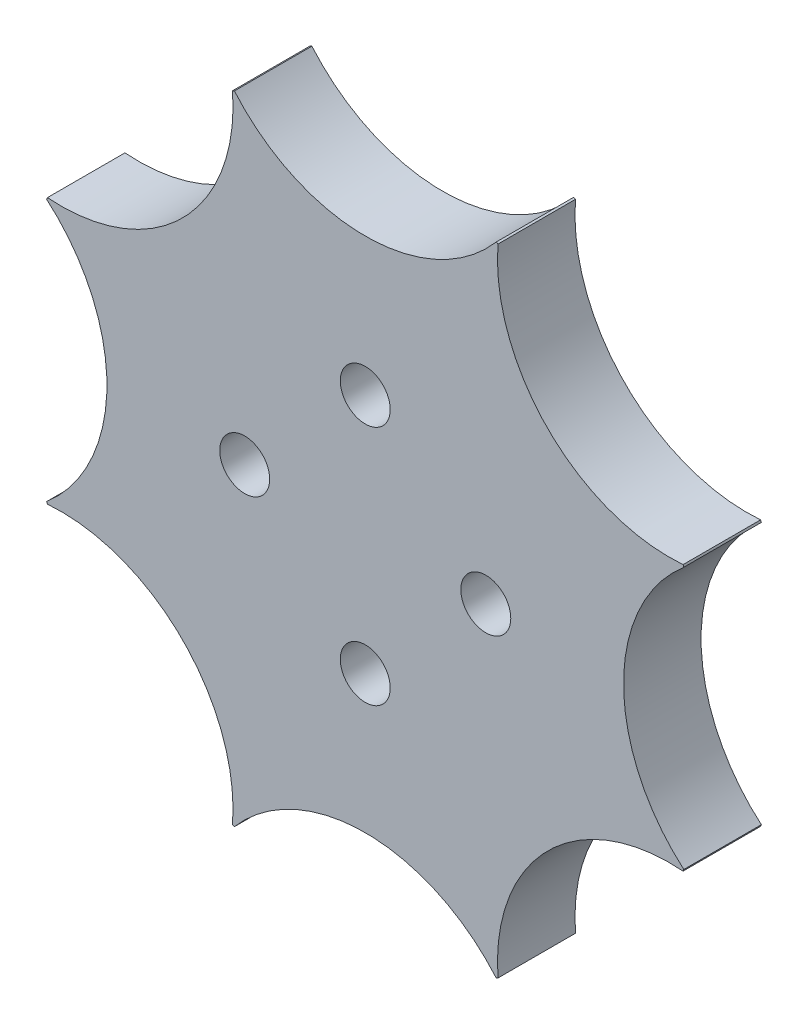
ISO-10303-21;
HEADER;
FILE_DESCRIPTION(('STEP AP214'),'2;1');
FILE_NAME('part.step','',(''),(''),'','','');
FILE_SCHEMA(('AUTOMOTIVE_DESIGN { 1 0 10303 214 1 1 1 1 }'));
ENDSEC;
DATA;
#1=APPLICATION_CONTEXT('core data for automotive mechanical design processes');
#2=APPLICATION_PROTOCOL_DEFINITION('international standard','automotive_design',2000,#1);
#3=PRODUCT_CONTEXT('',#1,'mechanical');
#4=PRODUCT('Part','Part','',(#3));
#5=PRODUCT_RELATED_PRODUCT_CATEGORY('part','',(#4));
#6=PRODUCT_DEFINITION_FORMATION('','',#4);
#7=PRODUCT_DEFINITION_CONTEXT('part definition',#1,'design');
#8=PRODUCT_DEFINITION('design','',#6,#7);
#9=PRODUCT_DEFINITION_SHAPE('','',#8);
#10=(LENGTH_UNIT() NAMED_UNIT(*) SI_UNIT(.MILLI.,.METRE.));
#11=(NAMED_UNIT(*) PLANE_ANGLE_UNIT() SI_UNIT($,.RADIAN.));
#12=(NAMED_UNIT(*) SI_UNIT($,.STERADIAN.) SOLID_ANGLE_UNIT());
#13=UNCERTAINTY_MEASURE_WITH_UNIT(LENGTH_MEASURE(1.E-05),#10,'distance_accuracy_value','');
#14=(GEOMETRIC_REPRESENTATION_CONTEXT(3) GLOBAL_UNCERTAINTY_ASSIGNED_CONTEXT((#13)) GLOBAL_UNIT_ASSIGNED_CONTEXT((#10,
#11,#12)) REPRESENTATION_CONTEXT('',''));
#15=CARTESIAN_POINT('',(0.,0.,0.));
#16=DIRECTION('',(0.,0.,1.));
#17=DIRECTION('',(1.,0.,0.));
#18=AXIS2_PLACEMENT_3D('',#15,#16,#17);
#19=CARTESIAN_POINT('',(-17.6776695296637,-17.6776695296637,4.5));
#20=DIRECTION('',(0.,0.,-1.));
#21=DIRECTION('',(-1.,0.,0.));
#22=AXIS2_PLACEMENT_3D('',#19,#20,#21);
#23=CYLINDRICAL_SURFACE('',#22,9.99999999999999);
#24=CARTESIAN_POINT('',(-17.6776695296637,-17.6776695296637,0.));
#25=DIRECTION('',(0.,0.,1.));
#26=DIRECTION('',(1.,0.,0.));
#27=AXIS2_PLACEMENT_3D('',#24,#25,#26);
#28=CIRCLE('',#27,9.99999999999999);
#29=CARTESIAN_POINT('',(-7.70792913689996,-18.4550217670023,0.));
#30=VERTEX_POINT('',#29);
#31=CARTESIAN_POINT('',(-18.4550217670023,-7.70792913689997,0.));
#32=VERTEX_POINT('',#31);
#33=EDGE_CURVE('E188',#30,#32,#28,.T.);
#34=ORIENTED_EDGE('',*,*,#33,.F.);
#35=DIRECTION('',(0.,0.,-1.));
#36=VECTOR('',#35,1.);
#37=CARTESIAN_POINT('',(-7.70792913689996,-18.4550217670023,4.5));
#38=LINE('',#37,#36);
#39=CARTESIAN_POINT('',(-7.70792913689996,-18.4550217670023,4.5));
#40=VERTEX_POINT('',#39);
#41=EDGE_CURVE('E11',#40,#30,#38,.T.);
#42=ORIENTED_EDGE('',*,*,#41,.F.);
#43=CARTESIAN_POINT('',(-17.6776695296637,-17.6776695296637,4.5));
#44=DIRECTION('',(0.,0.,1.));
#45=DIRECTION('',(1.,0.,0.));
#46=AXIS2_PLACEMENT_3D('',#43,#44,#45);
#47=CIRCLE('',#46,9.99999999999999);
#48=CARTESIAN_POINT('',(-18.4550217670023,-7.70792913689997,4.5));
#49=VERTEX_POINT('',#48);
#50=EDGE_CURVE('E276',#40,#49,#47,.T.);
#51=ORIENTED_EDGE('',*,*,#50,.T.);
#52=DIRECTION('',(0.,0.,-1.));
#53=VECTOR('',#52,1.);
#54=CARTESIAN_POINT('',(-18.4550217670023,-7.70792913689997,4.5));
#55=LINE('',#54,#53);
#56=EDGE_CURVE('E119',#49,#32,#55,.T.);
#57=ORIENTED_EDGE('',*,*,#56,.T.);
#58=EDGE_LOOP('',(#34,#42,#51,#57));
#59=FACE_BOUND('',#58,.T.);
#60=ADVANCED_FACE('F45',(#59),#23,.F.);
#61=CARTESIAN_POINT('',(0.,0.,4.5));
#62=DIRECTION('',(0.,0.,-1.));
#63=DIRECTION('',(-1.,0.,0.));
#64=AXIS2_PLACEMENT_3D('',#61,#62,#63);
#65=CYLINDRICAL_SURFACE('',#64,20.);
#66=CARTESIAN_POINT('',(0.,0.,0.));
#67=DIRECTION('',(0.,0.,1.));
#68=DIRECTION('',(1.,0.,0.));
#69=AXIS2_PLACEMENT_3D('',#66,#67,#68);
#70=CIRCLE('',#69,20.);
#71=CARTESIAN_POINT('',(-7.59934207678532,-18.5,0.));
#72=VERTEX_POINT('',#71);
#73=EDGE_CURVE('E191',#30,#72,#70,.T.);
#74=ORIENTED_EDGE('',*,*,#73,.T.);
#75=DIRECTION('',(0.,0.,-1.));
#76=VECTOR('',#75,1.);
#77=CARTESIAN_POINT('',(-7.59934207678532,-18.5,4.5));
#78=LINE('',#77,#76);
#79=CARTESIAN_POINT('',(-7.59934207678532,-18.5,4.5));
#80=VERTEX_POINT('',#79);
#81=EDGE_CURVE('E53',#80,#72,#78,.T.);
#82=ORIENTED_EDGE('',*,*,#81,.F.);
#83=CARTESIAN_POINT('',(0.,0.,4.5));
#84=DIRECTION('',(0.,0.,1.));
#85=DIRECTION('',(1.,0.,0.));
#86=AXIS2_PLACEMENT_3D('',#83,#84,#85);
#87=CIRCLE('',#86,20.);
#88=EDGE_CURVE('E184',#40,#80,#87,.T.);
#89=ORIENTED_EDGE('',*,*,#88,.F.);
#90=ORIENTED_EDGE('',*,*,#41,.T.);
#91=EDGE_LOOP('',(#74,#82,#89,#90));
#92=FACE_BOUND('',#91,.T.);
#93=ADVANCED_FACE('F252',(#92),#65,.T.);
#94=CARTESIAN_POINT('',(0.,-25.,4.5));
#95=DIRECTION('',(0.,0.,-1.));
#96=DIRECTION('',(-1.,0.,0.));
#97=AXIS2_PLACEMENT_3D('',#94,#95,#96);
#98=CYLINDRICAL_SURFACE('',#97,10.);
#99=CARTESIAN_POINT('',(0.,-25.,0.));
#100=DIRECTION('',(0.,0.,1.));
#101=DIRECTION('',(1.,0.,0.));
#102=AXIS2_PLACEMENT_3D('',#99,#100,#101);
#103=CIRCLE('',#102,10.);
#104=CARTESIAN_POINT('',(7.59934207678533,-18.5,0.));
#105=VERTEX_POINT('',#104);
#106=EDGE_CURVE('E195',#105,#72,#103,.T.);
#107=ORIENTED_EDGE('',*,*,#106,.F.);
#108=DIRECTION('',(0.,0.,-1.));
#109=VECTOR('',#108,1.);
#110=CARTESIAN_POINT('',(7.59934207678533,-18.5,4.5));
#111=LINE('',#110,#109);
#112=CARTESIAN_POINT('',(7.59934207678533,-18.5,4.5));
#113=VERTEX_POINT('',#112);
#114=EDGE_CURVE('E242',#113,#105,#111,.T.);
#115=ORIENTED_EDGE('',*,*,#114,.F.);
#116=CARTESIAN_POINT('',(0.,-25.,4.5));
#117=DIRECTION('',(0.,0.,1.));
#118=DIRECTION('',(1.,0.,0.));
#119=AXIS2_PLACEMENT_3D('',#116,#117,#118);
#120=CIRCLE('',#119,10.);
#121=EDGE_CURVE('E249',#113,#80,#120,.T.);
#122=ORIENTED_EDGE('',*,*,#121,.T.);
#123=ORIENTED_EDGE('',*,*,#81,.T.);
#124=EDGE_LOOP('',(#107,#115,#122,#123));
#125=FACE_BOUND('',#124,.T.);
#126=ADVANCED_FACE('F247',(#125),#98,.F.);
#127=CARTESIAN_POINT('',(7.70792913689997,-18.4550217670023,0.));
#128=VERTEX_POINT('',#127);
#129=EDGE_CURVE('E197',#105,#128,#70,.T.);
#130=ORIENTED_EDGE('',*,*,#129,.T.);
#131=DIRECTION('',(0.,0.,-1.));
#132=VECTOR('',#131,1.);
#133=CARTESIAN_POINT('',(7.70792913689997,-18.4550217670023,4.5));
#134=LINE('',#133,#132);
#135=CARTESIAN_POINT('',(7.70792913689997,-18.4550217670023,4.5));
#136=VERTEX_POINT('',#135);
#137=EDGE_CURVE('E240',#136,#128,#134,.T.);
#138=ORIENTED_EDGE('',*,*,#137,.F.);
#139=EDGE_CURVE('E278',#113,#136,#87,.T.);
#140=ORIENTED_EDGE('',*,*,#139,.F.);
#141=ORIENTED_EDGE('',*,*,#114,.T.);
#142=EDGE_LOOP('',(#130,#138,#140,#141));
#143=FACE_BOUND('',#142,.T.);
#144=ADVANCED_FACE('F306',(#143),#65,.T.);
#145=CARTESIAN_POINT('',(17.6776695296637,-17.6776695296637,4.5));
#146=DIRECTION('',(0.,0.,-1.));
#147=DIRECTION('',(-1.,0.,0.));
#148=AXIS2_PLACEMENT_3D('',#145,#146,#147);
#149=CYLINDRICAL_SURFACE('',#148,10.);
#150=CARTESIAN_POINT('',(17.6776695296637,-17.6776695296637,0.));
#151=DIRECTION('',(0.,0.,1.));
#152=DIRECTION('',(1.,0.,0.));
#153=AXIS2_PLACEMENT_3D('',#150,#151,#152);
#154=CIRCLE('',#153,10.);
#155=CARTESIAN_POINT('',(18.4550217670023,-7.70792913689996,0.));
#156=VERTEX_POINT('',#155);
#157=EDGE_CURVE('E200',#156,#128,#154,.T.);
#158=ORIENTED_EDGE('',*,*,#157,.F.);
#159=DIRECTION('',(0.,0.,-1.));
#160=VECTOR('',#159,1.);
#161=CARTESIAN_POINT('',(18.4550217670023,-7.70792913689996,4.5));
#162=LINE('',#161,#160);
#163=CARTESIAN_POINT('',(18.4550217670023,-7.70792913689996,4.5));
#164=VERTEX_POINT('',#163);
#165=EDGE_CURVE('E238',#164,#156,#162,.T.);
#166=ORIENTED_EDGE('',*,*,#165,.F.);
#167=CARTESIAN_POINT('',(17.6776695296637,-17.6776695296637,4.5));
#168=DIRECTION('',(0.,0.,1.));
#169=DIRECTION('',(1.,0.,0.));
#170=AXIS2_PLACEMENT_3D('',#167,#168,#169);
#171=CIRCLE('',#170,10.);
#172=EDGE_CURVE('E284',#164,#136,#171,.T.);
#173=ORIENTED_EDGE('',*,*,#172,.T.);
#174=ORIENTED_EDGE('',*,*,#137,.T.);
#175=EDGE_LOOP('',(#158,#166,#173,#174));
#176=FACE_BOUND('',#175,.T.);
#177=ADVANCED_FACE('F308',(#176),#149,.F.);
#178=CARTESIAN_POINT('',(18.5,-7.59934207678534,0.));
#179=VERTEX_POINT('',#178);
#180=EDGE_CURVE('E203',#156,#179,#70,.T.);
#181=ORIENTED_EDGE('',*,*,#180,.T.);
#182=DIRECTION('',(0.,0.,-1.));
#183=VECTOR('',#182,1.);
#184=CARTESIAN_POINT('',(18.5,-7.59934207678534,4.5));
#185=LINE('',#184,#183);
#186=CARTESIAN_POINT('',(18.5,-7.59934207678534,4.5));
#187=VERTEX_POINT('',#186);
#188=EDGE_CURVE('E236',#187,#179,#185,.T.);
#189=ORIENTED_EDGE('',*,*,#188,.F.);
#190=EDGE_CURVE('E287',#164,#187,#87,.T.);
#191=ORIENTED_EDGE('',*,*,#190,.F.);
#192=ORIENTED_EDGE('',*,*,#165,.T.);
#193=EDGE_LOOP('',(#181,#189,#191,#192));
#194=FACE_BOUND('',#193,.T.);
#195=ADVANCED_FACE('F309',(#194),#65,.T.);
#196=CARTESIAN_POINT('',(25.,0.,4.5));
#197=DIRECTION('',(0.,0.,-1.));
#198=DIRECTION('',(-1.,0.,0.));
#199=AXIS2_PLACEMENT_3D('',#196,#197,#198);
#200=CYLINDRICAL_SURFACE('',#199,10.);
#201=CARTESIAN_POINT('',(25.,0.,0.));
#202=DIRECTION('',(0.,0.,1.));
#203=DIRECTION('',(1.,0.,0.));
#204=AXIS2_PLACEMENT_3D('',#201,#202,#203);
#205=CIRCLE('',#204,10.);
#206=CARTESIAN_POINT('',(18.5,7.59934207678534,0.));
#207=VERTEX_POINT('',#206);
#208=EDGE_CURVE('E204',#207,#179,#205,.T.);
#209=ORIENTED_EDGE('',*,*,#208,.F.);
#210=DIRECTION('',(0.,0.,-1.));
#211=VECTOR('',#210,1.);
#212=CARTESIAN_POINT('',(18.5,7.59934207678534,4.5));
#213=LINE('',#212,#211);
#214=CARTESIAN_POINT('',(18.5,7.59934207678534,4.5));
#215=VERTEX_POINT('',#214);
#216=EDGE_CURVE('E234',#215,#207,#213,.T.);
#217=ORIENTED_EDGE('',*,*,#216,.F.);
#218=CARTESIAN_POINT('',(25.,0.,4.5));
#219=DIRECTION('',(0.,0.,1.));
#220=DIRECTION('',(1.,0.,0.));
#221=AXIS2_PLACEMENT_3D('',#218,#219,#220);
#222=CIRCLE('',#221,10.);
#223=EDGE_CURVE('E288',#215,#187,#222,.T.);
#224=ORIENTED_EDGE('',*,*,#223,.T.);
#225=ORIENTED_EDGE('',*,*,#188,.T.);
#226=EDGE_LOOP('',(#209,#217,#224,#225));
#227=FACE_BOUND('',#226,.T.);
#228=ADVANCED_FACE('F312',(#227),#200,.F.);
#229=CARTESIAN_POINT('',(18.4550217670023,7.70792913689997,0.));
#230=VERTEX_POINT('',#229);
#231=EDGE_CURVE('E207',#207,#230,#70,.T.);
#232=ORIENTED_EDGE('',*,*,#231,.T.);
#233=DIRECTION('',(0.,0.,-1.));
#234=VECTOR('',#233,1.);
#235=CARTESIAN_POINT('',(18.4550217670023,7.70792913689997,4.5));
#236=LINE('',#235,#234);
#237=CARTESIAN_POINT('',(18.4550217670023,7.70792913689997,4.5));
#238=VERTEX_POINT('',#237);
#239=EDGE_CURVE('E232',#238,#230,#236,.T.);
#240=ORIENTED_EDGE('',*,*,#239,.F.);
#241=EDGE_CURVE('E291',#215,#238,#87,.T.);
#242=ORIENTED_EDGE('',*,*,#241,.F.);
#243=ORIENTED_EDGE('',*,*,#216,.T.);
#244=EDGE_LOOP('',(#232,#240,#242,#243));
#245=FACE_BOUND('',#244,.T.);
#246=ADVANCED_FACE('F313',(#245),#65,.T.);
#247=CARTESIAN_POINT('',(17.6776695296637,17.6776695296637,4.5));
#248=DIRECTION('',(0.,0.,-1.));
#249=DIRECTION('',(-1.,0.,0.));
#250=AXIS2_PLACEMENT_3D('',#247,#248,#249);
#251=CYLINDRICAL_SURFACE('',#250,9.99999999999999);
#252=CARTESIAN_POINT('',(17.6776695296637,17.6776695296637,0.));
#253=DIRECTION('',(0.,0.,1.));
#254=DIRECTION('',(1.,0.,0.));
#255=AXIS2_PLACEMENT_3D('',#252,#253,#254);
#256=CIRCLE('',#255,9.99999999999999);
#257=CARTESIAN_POINT('',(7.70792913689996,18.4550217670023,0.));
#258=VERTEX_POINT('',#257);
#259=EDGE_CURVE('E208',#258,#230,#256,.T.);
#260=ORIENTED_EDGE('',*,*,#259,.F.);
#261=DIRECTION('',(0.,0.,-1.));
#262=VECTOR('',#261,1.);
#263=CARTESIAN_POINT('',(7.70792913689996,18.4550217670023,4.5));
#264=LINE('',#263,#262);
#265=CARTESIAN_POINT('',(7.70792913689996,18.4550217670023,4.5));
#266=VERTEX_POINT('',#265);
#267=EDGE_CURVE('E230',#266,#258,#264,.T.);
#268=ORIENTED_EDGE('',*,*,#267,.F.);
#269=CARTESIAN_POINT('',(17.6776695296637,17.6776695296637,4.5));
#270=DIRECTION('',(0.,0.,1.));
#271=DIRECTION('',(1.,0.,0.));
#272=AXIS2_PLACEMENT_3D('',#269,#270,#271);
#273=CIRCLE('',#272,9.99999999999999);
#274=EDGE_CURVE('E292',#266,#238,#273,.T.);
#275=ORIENTED_EDGE('',*,*,#274,.T.);
#276=ORIENTED_EDGE('',*,*,#239,.T.);
#277=EDGE_LOOP('',(#260,#268,#275,#276));
#278=FACE_BOUND('',#277,.T.);
#279=ADVANCED_FACE('F316',(#278),#251,.F.);
#280=CARTESIAN_POINT('',(7.59934207678532,18.5,0.));
#281=VERTEX_POINT('',#280);
#282=EDGE_CURVE('E211',#258,#281,#70,.T.);
#283=ORIENTED_EDGE('',*,*,#282,.T.);
#284=DIRECTION('',(0.,0.,-1.));
#285=VECTOR('',#284,1.);
#286=CARTESIAN_POINT('',(7.59934207678532,18.5,4.5));
#287=LINE('',#286,#285);
#288=CARTESIAN_POINT('',(7.59934207678532,18.5,4.5));
#289=VERTEX_POINT('',#288);
#290=EDGE_CURVE('E228',#289,#281,#287,.T.);
#291=ORIENTED_EDGE('',*,*,#290,.F.);
#292=EDGE_CURVE('E294',#266,#289,#87,.T.);
#293=ORIENTED_EDGE('',*,*,#292,.F.);
#294=ORIENTED_EDGE('',*,*,#267,.T.);
#295=EDGE_LOOP('',(#283,#291,#293,#294));
#296=FACE_BOUND('',#295,.T.);
#297=ADVANCED_FACE('F317',(#296),#65,.T.);
#298=CARTESIAN_POINT('',(0.,25.,4.5));
#299=DIRECTION('',(0.,0.,-1.));
#300=DIRECTION('',(-1.,0.,0.));
#301=AXIS2_PLACEMENT_3D('',#298,#299,#300);
#302=CYLINDRICAL_SURFACE('',#301,9.99999999999999);
#303=CARTESIAN_POINT('',(0.,25.,0.));
#304=DIRECTION('',(0.,0.,1.));
#305=DIRECTION('',(1.,0.,0.));
#306=AXIS2_PLACEMENT_3D('',#303,#304,#305);
#307=CIRCLE('',#306,9.99999999999999);
#308=CARTESIAN_POINT('',(-7.59934207678533,18.5,0.));
#309=VERTEX_POINT('',#308);
#310=EDGE_CURVE('E212',#309,#281,#307,.T.);
#311=ORIENTED_EDGE('',*,*,#310,.F.);
#312=DIRECTION('',(0.,0.,-1.));
#313=VECTOR('',#312,1.);
#314=CARTESIAN_POINT('',(-7.59934207678533,18.5,4.5));
#315=LINE('',#314,#313);
#316=CARTESIAN_POINT('',(-7.59934207678533,18.5,4.5));
#317=VERTEX_POINT('',#316);
#318=EDGE_CURVE('E226',#317,#309,#315,.T.);
#319=ORIENTED_EDGE('',*,*,#318,.F.);
#320=CARTESIAN_POINT('',(0.,25.,4.5));
#321=DIRECTION('',(0.,0.,1.));
#322=DIRECTION('',(1.,0.,0.));
#323=AXIS2_PLACEMENT_3D('',#320,#321,#322);
#324=CIRCLE('',#323,9.99999999999999);
#325=EDGE_CURVE('E295',#317,#289,#324,.T.);
#326=ORIENTED_EDGE('',*,*,#325,.T.);
#327=ORIENTED_EDGE('',*,*,#290,.T.);
#328=EDGE_LOOP('',(#311,#319,#326,#327));
#329=FACE_BOUND('',#328,.T.);
#330=ADVANCED_FACE('F319',(#329),#302,.F.);
#331=CARTESIAN_POINT('',(-7.70792913689996,18.4550217670023,0.));
#332=VERTEX_POINT('',#331);
#333=EDGE_CURVE('E215',#309,#332,#70,.T.);
#334=ORIENTED_EDGE('',*,*,#333,.T.);
#335=DIRECTION('',(0.,0.,-1.));
#336=VECTOR('',#335,1.);
#337=CARTESIAN_POINT('',(-7.70792913689996,18.4550217670023,4.5));
#338=LINE('',#337,#336);
#339=CARTESIAN_POINT('',(-7.70792913689996,18.4550217670023,4.5));
#340=VERTEX_POINT('',#339);
#341=EDGE_CURVE('E224',#340,#332,#338,.T.);
#342=ORIENTED_EDGE('',*,*,#341,.F.);
#343=EDGE_CURVE('E171',#317,#340,#87,.T.);
#344=ORIENTED_EDGE('',*,*,#343,.F.);
#345=ORIENTED_EDGE('',*,*,#318,.T.);
#346=EDGE_LOOP('',(#334,#342,#344,#345));
#347=FACE_BOUND('',#346,.T.);
#348=ADVANCED_FACE('F324',(#347),#65,.T.);
#349=CARTESIAN_POINT('',(-17.6776695296637,17.6776695296637,4.5));
#350=DIRECTION('',(0.,0.,-1.));
#351=DIRECTION('',(-1.,0.,0.));
#352=AXIS2_PLACEMENT_3D('',#349,#350,#351);
#353=CYLINDRICAL_SURFACE('',#352,10.);
#354=CARTESIAN_POINT('',(-17.6776695296637,17.6776695296637,0.));
#355=DIRECTION('',(0.,0.,1.));
#356=DIRECTION('',(1.,0.,0.));
#357=AXIS2_PLACEMENT_3D('',#354,#355,#356);
#358=CIRCLE('',#357,10.);
#359=CARTESIAN_POINT('',(-18.4550217670023,7.70792913689995,0.));
#360=VERTEX_POINT('',#359);
#361=EDGE_CURVE('E216',#360,#332,#358,.T.);
#362=ORIENTED_EDGE('',*,*,#361,.F.);
#363=DIRECTION('',(0.,0.,-1.));
#364=VECTOR('',#363,1.);
#365=CARTESIAN_POINT('',(-18.4550217670023,7.70792913689995,4.5));
#366=LINE('',#365,#364);
#367=CARTESIAN_POINT('',(-18.4550217670023,7.70792913689995,4.5));
#368=VERTEX_POINT('',#367);
#369=EDGE_CURVE('E180',#368,#360,#366,.T.);
#370=ORIENTED_EDGE('',*,*,#369,.F.);
#371=CARTESIAN_POINT('',(-17.6776695296637,17.6776695296637,4.5));
#372=DIRECTION('',(0.,0.,1.));
#373=DIRECTION('',(1.,0.,0.));
#374=AXIS2_PLACEMENT_3D('',#371,#372,#373);
#375=CIRCLE('',#374,10.);
#376=EDGE_CURVE('E168',#368,#340,#375,.T.);
#377=ORIENTED_EDGE('',*,*,#376,.T.);
#378=ORIENTED_EDGE('',*,*,#341,.T.);
#379=EDGE_LOOP('',(#362,#370,#377,#378));
#380=FACE_BOUND('',#379,.T.);
#381=ADVANCED_FACE('F323',(#380),#353,.F.);
#382=CARTESIAN_POINT('',(-18.5,7.59934207678533,0.));
#383=VERTEX_POINT('',#382);
#384=EDGE_CURVE('E176',#360,#383,#70,.T.);
#385=ORIENTED_EDGE('',*,*,#384,.T.);
#386=DIRECTION('',(0.,0.,-1.));
#387=VECTOR('',#386,1.);
#388=CARTESIAN_POINT('',(-18.5,7.59934207678533,4.5));
#389=LINE('',#388,#387);
#390=CARTESIAN_POINT('',(-18.5,7.59934207678533,4.5));
#391=VERTEX_POINT('',#390);
#392=EDGE_CURVE('E173',#391,#383,#389,.T.);
#393=ORIENTED_EDGE('',*,*,#392,.F.);
#394=EDGE_CURVE('E162',#368,#391,#87,.T.);
#395=ORIENTED_EDGE('',*,*,#394,.F.);
#396=ORIENTED_EDGE('',*,*,#369,.T.);
#397=EDGE_LOOP('',(#385,#393,#395,#396));
#398=FACE_BOUND('',#397,.T.);
#399=ADVANCED_FACE('F174',(#398),#65,.T.);
#400=CARTESIAN_POINT('',(-25.,0.,4.5));
#401=DIRECTION('',(0.,0.,-1.));
#402=DIRECTION('',(-1.,0.,0.));
#403=AXIS2_PLACEMENT_3D('',#400,#401,#402);
#404=CYLINDRICAL_SURFACE('',#403,9.99999999999999);
#405=CARTESIAN_POINT('',(-25.,0.,0.));
#406=DIRECTION('',(0.,0.,1.));
#407=DIRECTION('',(1.,0.,0.));
#408=AXIS2_PLACEMENT_3D('',#405,#406,#407);
#409=CIRCLE('',#408,9.99999999999999);
#410=CARTESIAN_POINT('',(-18.5,-7.59934207678533,0.));
#411=VERTEX_POINT('',#410);
#412=EDGE_CURVE('E219',#411,#383,#409,.T.);
#413=ORIENTED_EDGE('',*,*,#412,.F.);
#414=DIRECTION('',(0.,0.,-1.));
#415=VECTOR('',#414,1.);
#416=CARTESIAN_POINT('',(-18.5,-7.59934207678533,4.5));
#417=LINE('',#416,#415);
#418=CARTESIAN_POINT('',(-18.5,-7.59934207678533,4.5));
#419=VERTEX_POINT('',#418);
#420=EDGE_CURVE('E112',#419,#411,#417,.T.);
#421=ORIENTED_EDGE('',*,*,#420,.F.);
#422=CARTESIAN_POINT('',(-25.,0.,4.5));
#423=DIRECTION('',(0.,0.,1.));
#424=DIRECTION('',(1.,0.,0.));
#425=AXIS2_PLACEMENT_3D('',#422,#423,#424);
#426=CIRCLE('',#425,9.99999999999999);
#427=EDGE_CURVE('E166',#419,#391,#426,.T.);
#428=ORIENTED_EDGE('',*,*,#427,.T.);
#429=ORIENTED_EDGE('',*,*,#392,.T.);
#430=EDGE_LOOP('',(#413,#421,#428,#429));
#431=FACE_BOUND('',#430,.T.);
#432=ADVANCED_FACE('F182',(#431),#404,.F.);
#433=EDGE_CURVE('E196',#411,#32,#70,.T.);
#434=ORIENTED_EDGE('',*,*,#433,.T.);
#435=ORIENTED_EDGE('',*,*,#56,.F.);
#436=EDGE_CURVE('E61',#419,#49,#87,.T.);
#437=ORIENTED_EDGE('',*,*,#436,.F.);
#438=ORIENTED_EDGE('',*,*,#420,.T.);
#439=EDGE_LOOP('',(#434,#435,#437,#438));
#440=FACE_BOUND('',#439,.T.);
#441=ADVANCED_FACE('F333',(#440),#65,.T.);
#442=CARTESIAN_POINT('',(0.,0.,4.5));
#443=DIRECTION('',(0.,0.,1.));
#444=DIRECTION('',(1.,0.,0.));
#445=AXIS2_PLACEMENT_3D('',#442,#443,#444);
#446=PLANE('',#445);
#447=CARTESIAN_POINT('',(0.,7.,4.5));
#448=DIRECTION('',(0.,0.,1.));
#449=DIRECTION('',(1.,0.,0.));
#450=AXIS2_PLACEMENT_3D('',#447,#448,#449);
#451=CIRCLE('',#450,1.45);
#452=CARTESIAN_POINT('',(1.45,7.,4.5));
#453=VERTEX_POINT('',#452);
#454=EDGE_CURVE('E574',#453,#453,#451,.T.);
#455=ORIENTED_EDGE('',*,*,#454,.F.);
#456=EDGE_LOOP('',(#455));
#457=FACE_BOUND('',#456,.T.);
#458=CARTESIAN_POINT('',(7.0000000000002,1.97666086873723E-13,4.5));
#459=DIRECTION('',(0.,0.,1.));
#460=DIRECTION('',(1.,0.,0.));
#461=AXIS2_PLACEMENT_3D('',#458,#459,#460);
#462=CIRCLE('',#461,1.45);
#463=CARTESIAN_POINT('',(8.4500000000002,1.97666086873723E-13,4.5));
#464=VERTEX_POINT('',#463);
#465=EDGE_CURVE('E580',#464,#464,#462,.T.);
#466=ORIENTED_EDGE('',*,*,#465,.F.);
#467=EDGE_LOOP('',(#466));
#468=FACE_BOUND('',#467,.T.);
#469=CARTESIAN_POINT('',(3.95332173747447E-13,-7.,4.5));
#470=DIRECTION('',(0.,0.,1.));
#471=DIRECTION('',(1.,0.,0.));
#472=AXIS2_PLACEMENT_3D('',#469,#470,#471);
#473=CIRCLE('',#472,1.45);
#474=CARTESIAN_POINT('',(1.4500000000004,-7.,4.5));
#475=VERTEX_POINT('',#474);
#476=EDGE_CURVE('E586',#475,#475,#473,.T.);
#477=ORIENTED_EDGE('',*,*,#476,.F.);
#478=EDGE_LOOP('',(#477));
#479=FACE_BOUND('',#478,.T.);
#480=CARTESIAN_POINT('',(-6.9999999999998,-1.98523339633126E-13,4.5));
#481=DIRECTION('',(0.,0.,1.));
#482=DIRECTION('',(1.,0.,0.));
#483=AXIS2_PLACEMENT_3D('',#480,#481,#482);
#484=CIRCLE('',#483,1.45);
#485=CARTESIAN_POINT('',(-5.5499999999998,-1.98523339633126E-13,4.5));
#486=VERTEX_POINT('',#485);
#487=EDGE_CURVE('E592',#486,#486,#484,.T.);
#488=ORIENTED_EDGE('',*,*,#487,.F.);
#489=EDGE_LOOP('',(#488));
#490=FACE_BOUND('',#489,.T.);
#491=ORIENTED_EDGE('',*,*,#50,.F.);
#492=ORIENTED_EDGE('',*,*,#88,.T.);
#493=ORIENTED_EDGE('',*,*,#121,.F.);
#494=ORIENTED_EDGE('',*,*,#139,.T.);
#495=ORIENTED_EDGE('',*,*,#172,.F.);
#496=ORIENTED_EDGE('',*,*,#190,.T.);
#497=ORIENTED_EDGE('',*,*,#223,.F.);
#498=ORIENTED_EDGE('',*,*,#241,.T.);
#499=ORIENTED_EDGE('',*,*,#274,.F.);
#500=ORIENTED_EDGE('',*,*,#292,.T.);
#501=ORIENTED_EDGE('',*,*,#325,.F.);
#502=ORIENTED_EDGE('',*,*,#343,.T.);
#503=ORIENTED_EDGE('',*,*,#376,.F.);
#504=ORIENTED_EDGE('',*,*,#394,.T.);
#505=ORIENTED_EDGE('',*,*,#427,.F.);
#506=ORIENTED_EDGE('',*,*,#436,.T.);
#507=EDGE_LOOP('',(#491,#492,#493,#494,#495,#496,#497,#498,#499,#500,#501,#502,#503,#504,#505,#506));
#508=FACE_BOUND('',#507,.T.);
#509=ADVANCED_FACE('F164',(#457,#468,#479,#490,#508),#446,.T.);
#510=CARTESIAN_POINT('',(0.,0.,0.));
#511=DIRECTION('',(0.,0.,1.));
#512=DIRECTION('',(1.,0.,0.));
#513=AXIS2_PLACEMENT_3D('',#510,#511,#512);
#514=PLANE('',#513);
#515=CARTESIAN_POINT('',(0.,0.,0.));
#516=DIRECTION('',(0.,0.,1.));
#517=DIRECTION('',(1.,0.,0.));
#518=AXIS2_PLACEMENT_3D('',#515,#516,#517);
#519=CIRCLE('',#518,10.5);
#520=CARTESIAN_POINT('',(10.5,0.,0.));
#521=VERTEX_POINT('',#520);
#522=EDGE_CURVE('E280',#521,#521,#519,.T.);
#523=ORIENTED_EDGE('',*,*,#522,.T.);
#524=EDGE_LOOP('',(#523));
#525=FACE_BOUND('',#524,.T.);
#526=ORIENTED_EDGE('',*,*,#33,.T.);
#527=ORIENTED_EDGE('',*,*,#433,.F.);
#528=ORIENTED_EDGE('',*,*,#412,.T.);
#529=ORIENTED_EDGE('',*,*,#384,.F.);
#530=ORIENTED_EDGE('',*,*,#361,.T.);
#531=ORIENTED_EDGE('',*,*,#333,.F.);
#532=ORIENTED_EDGE('',*,*,#310,.T.);
#533=ORIENTED_EDGE('',*,*,#282,.F.);
#534=ORIENTED_EDGE('',*,*,#259,.T.);
#535=ORIENTED_EDGE('',*,*,#231,.F.);
#536=ORIENTED_EDGE('',*,*,#208,.T.);
#537=ORIENTED_EDGE('',*,*,#180,.F.);
#538=ORIENTED_EDGE('',*,*,#157,.T.);
#539=ORIENTED_EDGE('',*,*,#129,.F.);
#540=ORIENTED_EDGE('',*,*,#106,.T.);
#541=ORIENTED_EDGE('',*,*,#73,.F.);
#542=EDGE_LOOP('',(#526,#527,#528,#529,#530,#531,#532,#533,#534,#535,#536,#537,#538,#539,#540,#541));
#543=FACE_BOUND('',#542,.T.);
#544=ADVANCED_FACE('F255',(#525,#543),#514,.F.);
#545=CARTESIAN_POINT('',(0.,0.,2.));
#546=DIRECTION('',(0.,0.,-1.));
#547=DIRECTION('',(-1.,0.,0.));
#548=AXIS2_PLACEMENT_3D('',#545,#546,#547);
#549=CYLINDRICAL_SURFACE('',#548,10.5);
#550=CARTESIAN_POINT('',(0.,0.,2.));
#551=DIRECTION('',(0.,0.,1.));
#552=DIRECTION('',(1.,0.,0.));
#553=AXIS2_PLACEMENT_3D('',#550,#551,#552);
#554=CIRCLE('',#553,10.5);
#555=CARTESIAN_POINT('',(10.5,0.,2.));
#556=VERTEX_POINT('',#555);
#557=EDGE_CURVE('E192',#556,#556,#554,.T.);
#558=ORIENTED_EDGE('',*,*,#557,.T.);
#559=EDGE_LOOP('',(#558));
#560=FACE_BOUND('',#559,.T.);
#561=ORIENTED_EDGE('',*,*,#522,.F.);
#562=EDGE_LOOP('',(#561));
#563=FACE_BOUND('',#562,.T.);
#564=ADVANCED_FACE('F424',(#560,#563),#549,.F.);
#565=CARTESIAN_POINT('',(0.,0.,2.));
#566=DIRECTION('',(0.,0.,1.));
#567=DIRECTION('',(1.,0.,0.));
#568=AXIS2_PLACEMENT_3D('',#565,#566,#567);
#569=PLANE('',#568);
#570=CARTESIAN_POINT('',(0.,7.,2.));
#571=DIRECTION('',(0.,0.,1.));
#572=DIRECTION('',(1.,0.,0.));
#573=AXIS2_PLACEMENT_3D('',#570,#571,#572);
#574=CIRCLE('',#573,1.45);
#575=CARTESIAN_POINT('',(1.45,7.,2.));
#576=VERTEX_POINT('',#575);
#577=EDGE_CURVE('E577',#576,#576,#574,.F.);
#578=ORIENTED_EDGE('',*,*,#577,.F.);
#579=EDGE_LOOP('',(#578));
#580=FACE_BOUND('',#579,.T.);
#581=CARTESIAN_POINT('',(7.0000000000002,1.97666086873723E-13,2.));
#582=DIRECTION('',(0.,0.,1.));
#583=DIRECTION('',(1.,0.,0.));
#584=AXIS2_PLACEMENT_3D('',#581,#582,#583);
#585=CIRCLE('',#584,1.45);
#586=CARTESIAN_POINT('',(8.4500000000002,1.97666086873723E-13,2.));
#587=VERTEX_POINT('',#586);
#588=EDGE_CURVE('E583',#587,#587,#585,.F.);
#589=ORIENTED_EDGE('',*,*,#588,.F.);
#590=EDGE_LOOP('',(#589));
#591=FACE_BOUND('',#590,.T.);
#592=CARTESIAN_POINT('',(3.95332173747447E-13,-7.,2.));
#593=DIRECTION('',(0.,0.,1.));
#594=DIRECTION('',(1.,0.,0.));
#595=AXIS2_PLACEMENT_3D('',#592,#593,#594);
#596=CIRCLE('',#595,1.45);
#597=CARTESIAN_POINT('',(1.4500000000004,-7.,2.));
#598=VERTEX_POINT('',#597);
#599=EDGE_CURVE('E589',#598,#598,#596,.F.);
#600=ORIENTED_EDGE('',*,*,#599,.F.);
#601=EDGE_LOOP('',(#600));
#602=FACE_BOUND('',#601,.T.);
#603=CARTESIAN_POINT('',(-6.9999999999998,-1.98523339633126E-13,2.));
#604=DIRECTION('',(0.,0.,1.));
#605=DIRECTION('',(1.,0.,0.));
#606=AXIS2_PLACEMENT_3D('',#603,#604,#605);
#607=CIRCLE('',#606,1.45);
#608=CARTESIAN_POINT('',(-5.5499999999998,-1.98523339633126E-13,2.));
#609=VERTEX_POINT('',#608);
#610=EDGE_CURVE('E595',#609,#609,#607,.F.);
#611=ORIENTED_EDGE('',*,*,#610,.F.);
#612=EDGE_LOOP('',(#611));
#613=FACE_BOUND('',#612,.T.);
#614=ORIENTED_EDGE('',*,*,#557,.F.);
#615=EDGE_LOOP('',(#614));
#616=FACE_BOUND('',#615,.T.);
#617=ADVANCED_FACE('F433',(#580,#591,#602,#613,#616),#569,.F.);
#618=CARTESIAN_POINT('',(-6.9999999999998,-1.98523339633126E-13,-0.00100000000000013));
#619=DIRECTION('',(0.,0.,1.));
#620=DIRECTION('',(1.,0.,0.));
#621=AXIS2_PLACEMENT_3D('',#618,#619,#620);
#622=CYLINDRICAL_SURFACE('',#621,1.45);
#623=ORIENTED_EDGE('',*,*,#487,.T.);
#624=EDGE_LOOP('',(#623));
#625=FACE_BOUND('',#624,.T.);
#626=ORIENTED_EDGE('',*,*,#610,.T.);
#627=EDGE_LOOP('',(#626));
#628=FACE_BOUND('',#627,.T.);
#629=ADVANCED_FACE('F447',(#625,#628),#622,.F.);
#630=CARTESIAN_POINT('',(3.95332173747447E-13,-7.,-0.00100000000000013));
#631=DIRECTION('',(0.,0.,1.));
#632=DIRECTION('',(1.,0.,0.));
#633=AXIS2_PLACEMENT_3D('',#630,#631,#632);
#634=CYLINDRICAL_SURFACE('',#633,1.45);
#635=ORIENTED_EDGE('',*,*,#476,.T.);
#636=EDGE_LOOP('',(#635));
#637=FACE_BOUND('',#636,.T.);
#638=ORIENTED_EDGE('',*,*,#599,.T.);
#639=EDGE_LOOP('',(#638));
#640=FACE_BOUND('',#639,.T.);
#641=ADVANCED_FACE('F455',(#637,#640),#634,.F.);
#642=CARTESIAN_POINT('',(7.0000000000002,1.97666086873723E-13,-0.00100000000000013));
#643=DIRECTION('',(0.,0.,1.));
#644=DIRECTION('',(1.,0.,0.));
#645=AXIS2_PLACEMENT_3D('',#642,#643,#644);
#646=CYLINDRICAL_SURFACE('',#645,1.45);
#647=ORIENTED_EDGE('',*,*,#465,.T.);
#648=EDGE_LOOP('',(#647));
#649=FACE_BOUND('',#648,.T.);
#650=ORIENTED_EDGE('',*,*,#588,.T.);
#651=EDGE_LOOP('',(#650));
#652=FACE_BOUND('',#651,.T.);
#653=ADVANCED_FACE('F466',(#649,#652),#646,.F.);
#654=CARTESIAN_POINT('',(0.,7.,-0.00100000000000013));
#655=DIRECTION('',(0.,0.,1.));
#656=DIRECTION('',(1.,0.,0.));
#657=AXIS2_PLACEMENT_3D('',#654,#655,#656);
#658=CYLINDRICAL_SURFACE('',#657,1.45);
#659=ORIENTED_EDGE('',*,*,#454,.T.);
#660=EDGE_LOOP('',(#659));
#661=FACE_BOUND('',#660,.T.);
#662=ORIENTED_EDGE('',*,*,#577,.T.);
#663=EDGE_LOOP('',(#662));
#664=FACE_BOUND('',#663,.T.);
#665=ADVANCED_FACE('F477',(#661,#664),#658,.F.);
#666=CLOSED_SHELL('',(#60,#93,#126,#144,#177,#195,#228,#246,#279,#297,#330,#348,#381,#399,#432,
#441,#509,#544,#564,#617,#629,#641,#653,#665));
#667=MANIFOLD_SOLID_BREP('B2',#666);
#668=ADVANCED_BREP_SHAPE_REPRESENTATION('',(#18,#667),#14);
#669=SHAPE_DEFINITION_REPRESENTATION(#9,#668);
ENDSEC;
END-ISO-10303-21;
